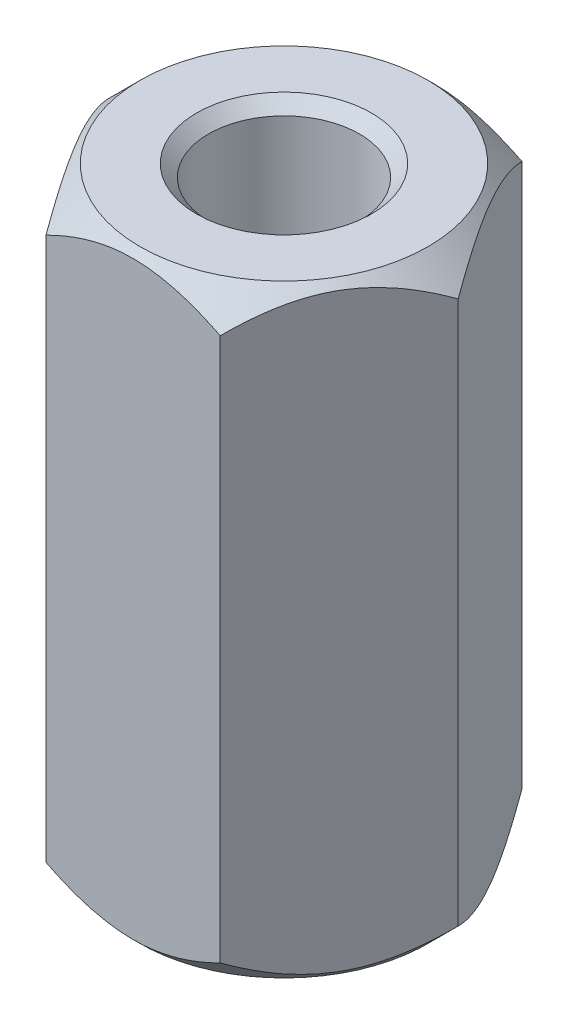
ISO-10303-21;
HEADER;
FILE_DESCRIPTION(('STEP AP214'),'2;1');
FILE_NAME('part.step','',(''),(''),'','','');
FILE_SCHEMA(('AUTOMOTIVE_DESIGN { 1 0 10303 214 1 1 1 1 }'));
ENDSEC;
DATA;
#1=APPLICATION_CONTEXT('core data for automotive mechanical design processes');
#2=APPLICATION_PROTOCOL_DEFINITION('international standard','automotive_design',2000,#1);
#3=PRODUCT_CONTEXT('',#1,'mechanical');
#4=PRODUCT('Part','Part','',(#3));
#5=PRODUCT_RELATED_PRODUCT_CATEGORY('part','',(#4));
#6=PRODUCT_DEFINITION_FORMATION('','',#4);
#7=PRODUCT_DEFINITION_CONTEXT('part definition',#1,'design');
#8=PRODUCT_DEFINITION('design','',#6,#7);
#9=PRODUCT_DEFINITION_SHAPE('','',#8);
#10=(LENGTH_UNIT() NAMED_UNIT(*) SI_UNIT(.MILLI.,.METRE.));
#11=(NAMED_UNIT(*) PLANE_ANGLE_UNIT() SI_UNIT($,.RADIAN.));
#12=(NAMED_UNIT(*) SI_UNIT($,.STERADIAN.) SOLID_ANGLE_UNIT());
#13=UNCERTAINTY_MEASURE_WITH_UNIT(LENGTH_MEASURE(1.E-05),#10,'distance_accuracy_value','');
#14=(GEOMETRIC_REPRESENTATION_CONTEXT(3) GLOBAL_UNCERTAINTY_ASSIGNED_CONTEXT((#13)) GLOBAL_UNIT_ASSIGNED_CONTEXT((#10,
#11,#12)) REPRESENTATION_CONTEXT('',''));
#15=CARTESIAN_POINT('',(0.,0.,0.));
#16=DIRECTION('',(0.,0.,1.));
#17=DIRECTION('',(1.,0.,0.));
#18=AXIS2_PLACEMENT_3D('',#15,#16,#17);
#19=CARTESIAN_POINT('',(0.,10.,0.));
#20=DIRECTION('',(0.,1.,0.));
#21=DIRECTION('',(0.,0.,1.));
#22=AXIS2_PLACEMENT_3D('',#19,#20,#21);
#23=PLANE('',#22);
#24=CARTESIAN_POINT('',(0.,10.,0.));
#25=DIRECTION('',(0.,1.,0.));
#26=DIRECTION('',(0.,0.,1.));
#27=AXIS2_PLACEMENT_3D('',#24,#25,#26);
#28=CIRCLE('',#27,1.45);
#29=CARTESIAN_POINT('',(0.,10.,1.45));
#30=VERTEX_POINT('',#29);
#31=EDGE_CURVE('E156',#30,#30,#28,.F.);
#32=ORIENTED_EDGE('',*,*,#31,.T.);
#33=EDGE_LOOP('',(#32));
#34=FACE_BOUND('',#33,.T.);
#35=CARTESIAN_POINT('',(0.,10.,0.));
#36=DIRECTION('',(0.,-1.,0.));
#37=DIRECTION('',(0.,0.,-1.));
#38=AXIS2_PLACEMENT_3D('',#35,#36,#37);
#39=CIRCLE('',#38,2.38675134594813);
#40=CARTESIAN_POINT('',(0.,10.,-2.38675134594813));
#41=VERTEX_POINT('',#40);
#42=EDGE_CURVE('E264',#41,#41,#39,.T.);
#43=ORIENTED_EDGE('',*,*,#42,.F.);
#44=EDGE_LOOP('',(#43));
#45=FACE_BOUND('',#44,.T.);
#46=ADVANCED_FACE('F41',(#34,#45),#23,.T.);
#47=CARTESIAN_POINT('',(0.,0.,0.));
#48=DIRECTION('',(0.,1.,0.));
#49=DIRECTION('',(0.,0.,1.));
#50=AXIS2_PLACEMENT_3D('',#47,#48,#49);
#51=PLANE('',#50);
#52=CARTESIAN_POINT('',(0.,0.,0.));
#53=DIRECTION('',(0.,-1.,0.));
#54=DIRECTION('',(0.,0.,-1.));
#55=AXIS2_PLACEMENT_3D('',#52,#53,#54);
#56=CIRCLE('',#55,2.38675134594813);
#57=CARTESIAN_POINT('',(0.,0.,-2.38675134594813));
#58=VERTEX_POINT('',#57);
#59=EDGE_CURVE('E269',#58,#58,#56,.T.);
#60=ORIENTED_EDGE('',*,*,#59,.T.);
#61=EDGE_LOOP('',(#60));
#62=FACE_BOUND('',#61,.T.);
#63=CARTESIAN_POINT('',(0.,0.,0.));
#64=DIRECTION('',(0.,1.,0.));
#65=DIRECTION('',(0.,0.,1.));
#66=AXIS2_PLACEMENT_3D('',#63,#64,#65);
#67=CIRCLE('',#66,1.45);
#68=CARTESIAN_POINT('',(0.,0.,1.45));
#69=VERTEX_POINT('',#68);
#70=EDGE_CURVE('E135',#69,#69,#67,.T.);
#71=ORIENTED_EDGE('',*,*,#70,.T.);
#72=EDGE_LOOP('',(#71));
#73=FACE_BOUND('',#72,.T.);
#74=ADVANCED_FACE('F277',(#62,#73),#51,.F.);
#75=CARTESIAN_POINT('',(0.,10.,0.));
#76=DIRECTION('',(0.,-1.,0.));
#77=DIRECTION('',(0.,0.,-1.));
#78=AXIS2_PLACEMENT_3D('',#75,#76,#77);
#79=CYLINDRICAL_SURFACE('',#78,1.25);
#80=CARTESIAN_POINT('',(0.,0.200000000000001,0.));
#81=DIRECTION('',(0.,1.,0.));
#82=DIRECTION('',(0.,0.,1.));
#83=AXIS2_PLACEMENT_3D('',#80,#81,#82);
#84=CIRCLE('',#83,1.25);
#85=CARTESIAN_POINT('',(0.,0.200000000000001,1.25));
#86=VERTEX_POINT('',#85);
#87=EDGE_CURVE('E152',#86,#86,#84,.F.);
#88=ORIENTED_EDGE('',*,*,#87,.T.);
#89=EDGE_LOOP('',(#88));
#90=FACE_BOUND('',#89,.T.);
#91=CARTESIAN_POINT('',(0.,9.8,0.));
#92=DIRECTION('',(0.,1.,0.));
#93=DIRECTION('',(0.,0.,1.));
#94=AXIS2_PLACEMENT_3D('',#91,#92,#93);
#95=CIRCLE('',#94,1.25);
#96=CARTESIAN_POINT('',(0.,9.8,1.25));
#97=VERTEX_POINT('',#96);
#98=EDGE_CURVE('E142',#97,#97,#95,.T.);
#99=ORIENTED_EDGE('',*,*,#98,.T.);
#100=EDGE_LOOP('',(#99));
#101=FACE_BOUND('',#100,.T.);
#102=ADVANCED_FACE('F175',(#90,#101),#79,.F.);
#103=CARTESIAN_POINT('',(0.,0.,0.));
#104=DIRECTION('',(0.,-1.,0.));
#105=DIRECTION('',(0.,0.,-1.));
#106=AXIS2_PLACEMENT_3D('',#103,#104,#105);
#107=CONICAL_SURFACE('',#106,1.45,0.785398163397451);
#108=ORIENTED_EDGE('',*,*,#87,.F.);
#109=EDGE_LOOP('',(#108));
#110=FACE_BOUND('',#109,.T.);
#111=ORIENTED_EDGE('',*,*,#70,.F.);
#112=EDGE_LOOP('',(#111));
#113=FACE_BOUND('',#112,.T.);
#114=ADVANCED_FACE('F282',(#110,#113),#107,.F.);
#115=CARTESIAN_POINT('',(0.,9.8,0.));
#116=DIRECTION('',(0.,1.,0.));
#117=DIRECTION('',(0.,0.,1.));
#118=AXIS2_PLACEMENT_3D('',#115,#116,#117);
#119=CONICAL_SURFACE('',#118,1.25,0.785398163397447);
#120=ORIENTED_EDGE('',*,*,#31,.F.);
#121=EDGE_LOOP('',(#120));
#122=FACE_BOUND('',#121,.T.);
#123=ORIENTED_EDGE('',*,*,#98,.F.);
#124=EDGE_LOOP('',(#123));
#125=FACE_BOUND('',#124,.T.);
#126=ADVANCED_FACE('F44',(#122,#125),#119,.F.);
#127=CARTESIAN_POINT('',(0.,0.5,0.));
#128=DIRECTION('',(0.,1.,0.));
#129=DIRECTION('',(0.,0.,1.));
#130=AXIS2_PLACEMENT_3D('',#127,#128,#129);
#131=CONICAL_SURFACE('',#130,2.88675134594813,0.785398163397448);
#132=ORIENTED_EDGE('',*,*,#59,.F.);
#133=EDGE_LOOP('',(#132));
#134=FACE_BOUND('',#133,.T.);
#135=CARTESIAN_POINT('',(1.44326020292023,0.500115476981765,2.5002));
#136=CARTESIAN_POINT('',(1.49287669073468,0.450540705354728,2.41426172221224));
#137=CARTESIAN_POINT('',(1.5433228376411,0.403877481362506,2.32688643272425));
#138=CARTESIAN_POINT('',(1.64618811625259,0.318438140038302,2.14871854383441));
#139=CARTESIAN_POINT('',(1.69861703122359,0.279709562406002,2.05790899931893));
#140=CARTESIAN_POINT('',(1.80433744175985,0.213366703897739,1.87479587687308));
#141=CARTESIAN_POINT('',(1.85760201171315,0.185585668530856,1.78253893547066));
#142=CARTESIAN_POINT('',(1.96530378549009,0.142783175910666,1.59599399122372));
#143=CARTESIAN_POINT('',(2.01973769896306,0.127729766671344,1.50171168743372));
#144=CARTESIAN_POINT('',(2.11355131286832,0.114147722209481,1.33922174170816));
#145=CARTESIAN_POINT('',(2.15280980880341,0.112137099240801,1.27122403211985));
#146=CARTESIAN_POINT('',(2.23126263056549,0.115524117187488,1.13533975883078));
#147=CARTESIAN_POINT('',(2.27045692907357,0.12092435529982,1.06745324244777));
#148=CARTESIAN_POINT('',(2.34847544336504,0.138825788402472,0.932321211763899));
#149=CARTESIAN_POINT('',(2.38729919566122,0.15133492704648,0.865076500246444));
#150=CARTESIAN_POINT('',(2.46427534467603,0.182767501955706,0.731749899181806));
#151=CARTESIAN_POINT('',(2.50242779262541,0.201690446496817,0.665667920900348));
#152=CARTESIAN_POINT('',(2.60015256308361,0.257867361408246,0.49640365330874));
#153=CARTESIAN_POINT('',(2.65911894852988,0.299355831596186,0.394270877777111));
#154=CARTESIAN_POINT('',(2.74582384890657,0.369394046723088,0.244093585059494));
#155=CARTESIAN_POINT('',(2.77439698586412,0.394002252116074,0.194603460117393));
#156=CARTESIAN_POINT('',(2.83101398781794,0.445461886715235,0.0965399361611541));
#157=CARTESIAN_POINT('',(2.85905816495513,0.472311938779356,0.0479659965030725));
#158=CARTESIAN_POINT('',(2.88686681600197,0.500115476981765,-0.000199999999999819));
#159=B_SPLINE_CURVE_WITH_KNOTS('',3,(#135,#136,#137,#138,#139,#140,#141,#142,#143,#144,#145,
#146,#147,#148,#149,#150,#151,#152,#153,#154,#155,#156,#157,#158),.UNSPECIFIED.,.F.,.F.,(4,2,2,
2,2,2,2,2,2,2,2,4),(0.,0.333012085133923,0.667964518301396,0.997597032043297,1.32639954393844,
1.56169424147168,1.79707142102082,2.0327121352217,2.2683347877565,2.64260240809533,
2.82922877818864,3.01574133749025),.UNSPECIFIED.);
#160=CARTESIAN_POINT('',(1.44337567297406,0.5,2.5));
#161=VERTEX_POINT('',#160);
#162=CARTESIAN_POINT('',(2.88675134594813,0.5,0.));
#163=VERTEX_POINT('',#162);
#164=EDGE_CURVE('E57',#161,#163,#159,.T.);
#165=ORIENTED_EDGE('',*,*,#164,.F.);
#166=CARTESIAN_POINT('',(-4.37330831151522,2.65069101973389,2.5));
#167=CARTESIAN_POINT('',(-4.24403891339305,2.53850828595441,2.5));
#168=CARTESIAN_POINT('',(-4.11419779057852,2.42697083242165,2.5));
#169=CARTESIAN_POINT('',(-3.85292831776437,2.20564673414319,2.5));
#170=CARTESIAN_POINT('',(-3.72149924661623,2.09586094177348,2.5));
#171=CARTESIAN_POINT('',(-3.45372373243149,1.87613936282999,2.5));
#172=CARTESIAN_POINT('',(-3.31733341076398,1.76625684230869,2.5));
#173=CARTESIAN_POINT('',(-3.04199251465964,1.54980326125021,2.5));
#174=CARTESIAN_POINT('',(-2.90304258923331,1.44323137919174,2.5));
#175=CARTESIAN_POINT('',(-2.62155122685079,1.23451661377687,2.5));
#176=CARTESIAN_POINT('',(-2.47900532618292,1.13237971133423,2.5));
#177=CARTESIAN_POINT('',(-2.18923565754107,0.934620051384672,2.5));
#178=CARTESIAN_POINT('',(-2.0420082049592,0.839002620916072,2.5));
#179=CARTESIAN_POINT('',(-1.74264031099183,0.658345048643878,2.5));
#180=CARTESIAN_POINT('',(-1.59054539844743,0.573230443151914,2.5));
#181=CARTESIAN_POINT('',(-1.27884700562957,0.41810967075028,2.5));
#182=CARTESIAN_POINT('',(-1.11925792354922,0.348075868732266,2.5));
#183=CARTESIAN_POINT('',(-0.871746541156393,0.259727643601026,2.5));
#184=CARTESIAN_POINT('',(-0.786892324781199,0.232859478936288,2.5));
#185=CARTESIAN_POINT('',(-0.615167909356123,0.186495703040525,2.5));
#186=CARTESIAN_POINT('',(-0.528298034126085,0.166998916167443,2.5));
#187=CARTESIAN_POINT('',(-0.353593154862556,0.136675918402707,2.5));
#188=CARTESIAN_POINT('',(-0.265767670553387,0.125795891290058,2.5));
#189=CARTESIAN_POINT('',(-0.0894544026248823,0.113303806761095,2.5));
#190=CARTESIAN_POINT('',(-0.000966693475837861,0.111690722460558,2.5));
#191=CARTESIAN_POINT('',(0.175810523180242,0.117862685412344,2.5));
#192=CARTESIAN_POINT('',(0.264099508971327,0.125662341658241,2.5));
#193=CARTESIAN_POINT('',(0.439438821736604,0.150088988425528,2.5));
#194=CARTESIAN_POINT('',(0.526488897979867,0.166717740414045,2.5));
#195=CARTESIAN_POINT('',(0.699335269567239,0.207851477940081,2.5));
#196=CARTESIAN_POINT('',(0.785118069808452,0.232412173795672,2.5));
#197=CARTESIAN_POINT('',(0.954502739735362,0.288070453345723,2.5));
#198=CARTESIAN_POINT('',(1.03810457634724,0.319168136107411,2.5));
#199=CARTESIAN_POINT('',(1.22117743579866,0.394047706308,2.5));
#200=CARTESIAN_POINT('',(1.32011771074674,0.439116117071025,2.5));
#201=CARTESIAN_POINT('',(1.51505599272674,0.535268622396139,2.5));
#202=CARTESIAN_POINT('',(1.61105226698903,0.586356177180437,2.5));
#203=CARTESIAN_POINT('',(1.80064305278511,0.693211834080635,2.5));
#204=CARTESIAN_POINT('',(1.89423220185576,0.748989373251979,2.5));
#205=CARTESIAN_POINT('',(2.07918348925537,0.86405882340105,2.5));
#206=CARTESIAN_POINT('',(2.17054606308418,0.923350039219493,2.5));
#207=CARTESIAN_POINT('',(2.35190572333799,1.04499939060216,2.5));
#208=CARTESIAN_POINT('',(2.44189291292773,1.10737221266217,2.5));
#209=CARTESIAN_POINT('',(2.62030949566039,1.23431260012175,2.5));
#210=CARTESIAN_POINT('',(2.70873877055447,1.29888033103894,2.5));
#211=CARTESIAN_POINT('',(2.97186750498212,1.49503424460034,2.5));
#212=CARTESIAN_POINT('',(3.14462607468669,1.62922074653838,2.5));
#213=CARTESIAN_POINT('',(3.49618284627761,1.90993648836438,2.5));
#214=CARTESIAN_POINT('',(3.67476512358034,2.05673353168176,2.5));
#215=CARTESIAN_POINT('',(3.93944124625689,2.27875476952709,2.5));
#216=CARTESIAN_POINT('',(4.02665635053339,2.35264928946925,2.5));
#217=CARTESIAN_POINT('',(4.20043882061448,2.5011578688468,2.5));
#218=CARTESIAN_POINT('',(4.28700632493623,2.57577176611582,2.5));
#219=CARTESIAN_POINT('',(4.37330831151522,2.65069101973389,2.5));
#220=B_SPLINE_CURVE_WITH_KNOTS('',3,(#166,#167,#168,#169,#170,#171,#172,#173,#174,#175,#176,
#177,#178,#179,#180,#181,#182,#183,#184,#185,#186,#187,#188,#189,#190,#191,#192,#193,#194,#195,
#196,#197,#198,#199,#200,#201,#202,#203,#204,#205,#206,#207,#208,#209,#210,#211,#212,#213,#214,
#215,#216,#217,#218,#219),.UNSPECIFIED.,.F.,.F.,(4,2,2,2,2,2,2,2,2,2,2,2,2,2,2,2,2,2,2,2,2,2,2,
2,2,2,4),(0.,0.513489343339091,1.02722137052991,1.5526256728989,2.0778985396552,
2.60385907177581,3.13024433807344,3.65265219152264,4.17409444495664,4.44084802746818,
4.70755904817345,4.9725908841579,5.23759335098937,5.50300764297449,5.76847490689832,
6.03584878933086,6.3032267240737,6.62911493104157,6.95519140377336,7.28194046381501,
7.60862509299869,7.9370542005098,8.26550812997353,8.92162297206542,9.61508301907986,
9.95801106567934,10.3008635353394),.UNSPECIFIED.);
#221=CARTESIAN_POINT('',(-1.44337567297406,0.5,2.5));
#222=VERTEX_POINT('',#221);
#223=EDGE_CURVE('E182',#222,#161,#220,.T.);
#224=ORIENTED_EDGE('',*,*,#223,.F.);
#225=CARTESIAN_POINT('',(-2.88686681600197,0.500115476981765,-0.000199999999999099));
#226=CARTESIAN_POINT('',(-2.83725032818751,0.450540705354727,0.0857382777877655));
#227=CARTESIAN_POINT('',(-2.7868041812811,0.403877481362506,0.173113567275754));
#228=CARTESIAN_POINT('',(-2.6839389026696,0.318438140038302,0.351281456165588));
#229=CARTESIAN_POINT('',(-2.6315099876986,0.279709562406003,0.442091000681074));
#230=CARTESIAN_POINT('',(-2.52578957716234,0.213366703897739,0.625204123126919));
#231=CARTESIAN_POINT('',(-2.47252500720904,0.185585668530856,0.717461064529339));
#232=CARTESIAN_POINT('',(-2.3648232334321,0.142783175910666,0.904006008776283));
#233=CARTESIAN_POINT('',(-2.31038931995913,0.127729766671344,0.998288312566281));
#234=CARTESIAN_POINT('',(-2.21657570605387,0.114147722209482,1.16077825829184));
#235=CARTESIAN_POINT('',(-2.17731721011878,0.112137099240801,1.22877596788015));
#236=CARTESIAN_POINT('',(-2.0988643883567,0.115524117187488,1.36466024116922));
#237=CARTESIAN_POINT('',(-2.05967008984862,0.12092435529982,1.43254675755223));
#238=CARTESIAN_POINT('',(-1.98165157555715,0.138825788402471,1.5676787882361));
#239=CARTESIAN_POINT('',(-1.94282782326097,0.151334927046479,1.63492349975355));
#240=CARTESIAN_POINT('',(-1.86585167424616,0.182767501955705,1.76825010081819));
#241=CARTESIAN_POINT('',(-1.82769922629678,0.201690446496817,1.83433207909965));
#242=CARTESIAN_POINT('',(-1.72997445583858,0.257867361408246,2.00359634669126));
#243=CARTESIAN_POINT('',(-1.67100807039231,0.299355831596185,2.10572912222289));
#244=CARTESIAN_POINT('',(-1.58430317001562,0.369394046723087,2.25590641494051));
#245=CARTESIAN_POINT('',(-1.55573003305807,0.394002252116073,2.30539653988261));
#246=CARTESIAN_POINT('',(-1.49911303110425,0.445461886715236,2.40346006383885));
#247=CARTESIAN_POINT('',(-1.47106885396706,0.472311938779356,2.45203400349693));
#248=CARTESIAN_POINT('',(-1.44326020292022,0.500115476981764,2.5002));
#249=B_SPLINE_CURVE_WITH_KNOTS('',3,(#225,#226,#227,#228,#229,#230,#231,#232,#233,#234,#235,
#236,#237,#238,#239,#240,#241,#242,#243,#244,#245,#246,#247,#248),.UNSPECIFIED.,.F.,.F.,(4,2,2,
2,2,2,2,2,2,2,2,4),(0.,0.333012085133923,0.667964518301395,0.997597032043296,1.32639954393844,
1.56169424147168,1.79707142102082,2.0327121352217,2.2683347877565,2.64260240809533,
2.82922877818864,3.01574133749025),.UNSPECIFIED.);
#250=CARTESIAN_POINT('',(-2.88675134594813,0.5,0.));
#251=VERTEX_POINT('',#250);
#252=EDGE_CURVE('E190',#251,#222,#249,.T.);
#253=ORIENTED_EDGE('',*,*,#252,.F.);
#254=CARTESIAN_POINT('',(-1.44326020292023,0.500115476981765,-2.5002));
#255=CARTESIAN_POINT('',(-1.49287669073468,0.450540705354727,-2.41426172221223));
#256=CARTESIAN_POINT('',(-1.5433228376411,0.403877481362506,-2.32688643272425));
#257=CARTESIAN_POINT('',(-1.64618811625259,0.318438140038301,-2.14871854383441));
#258=CARTESIAN_POINT('',(-1.69861703122359,0.279709562406002,-2.05790899931892));
#259=CARTESIAN_POINT('',(-1.80433744175985,0.213366703897739,-1.87479587687308));
#260=CARTESIAN_POINT('',(-1.85760201171315,0.185585668530856,-1.78253893547066));
#261=CARTESIAN_POINT('',(-1.96530378549009,0.142783175910666,-1.59599399122372));
#262=CARTESIAN_POINT('',(-2.01973769896306,0.127729766671344,-1.50171168743372));
#263=CARTESIAN_POINT('',(-2.11355131286832,0.114147722209482,-1.33922174170816));
#264=CARTESIAN_POINT('',(-2.15280980880341,0.112137099240802,-1.27122403211985));
#265=CARTESIAN_POINT('',(-2.23126263056549,0.115524117187488,-1.13533975883078));
#266=CARTESIAN_POINT('',(-2.27045692907357,0.12092435529982,-1.06745324244776));
#267=CARTESIAN_POINT('',(-2.34847544336504,0.138825788402471,-0.932321211763898));
#268=CARTESIAN_POINT('',(-2.38729919566122,0.15133492704648,-0.865076500246443));
#269=CARTESIAN_POINT('',(-2.46427534467603,0.182767501955706,-0.731749899181805));
#270=CARTESIAN_POINT('',(-2.50242779262541,0.201690446496817,-0.665667920900347));
#271=CARTESIAN_POINT('',(-2.60015256308361,0.257867361408246,-0.496403653308739));
#272=CARTESIAN_POINT('',(-2.65911894852988,0.299355831596186,-0.39427087777711));
#273=CARTESIAN_POINT('',(-2.74582384890657,0.369394046723087,-0.244093585059492));
#274=CARTESIAN_POINT('',(-2.77439698586412,0.394002252116074,-0.194603460117391));
#275=CARTESIAN_POINT('',(-2.83101398781794,0.445461886715236,-0.0965399361611533));
#276=CARTESIAN_POINT('',(-2.85905816495513,0.472311938779357,-0.0479659965030718));
#277=CARTESIAN_POINT('',(-2.88686681600197,0.500115476981765,0.000200000000001053));
#278=B_SPLINE_CURVE_WITH_KNOTS('',3,(#254,#255,#256,#257,#258,#259,#260,#261,#262,#263,#264,
#265,#266,#267,#268,#269,#270,#271,#272,#273,#274,#275,#276,#277),.UNSPECIFIED.,.F.,.F.,(4,2,2,
2,2,2,2,2,2,2,2,4),(0.,0.333012085133924,0.667964518301396,0.997597032043297,1.32639954393844,
1.56169424147168,1.79707142102082,2.0327121352217,2.2683347877565,2.64260240809533,
2.82922877818864,3.01574133749025),.UNSPECIFIED.);
#279=CARTESIAN_POINT('',(-1.44337567297406,0.5,-2.5));
#280=VERTEX_POINT('',#279);
#281=EDGE_CURVE('E114',#280,#251,#278,.T.);
#282=ORIENTED_EDGE('',*,*,#281,.F.);
#283=CARTESIAN_POINT('',(4.37330831151522,2.6506910197339,-2.5));
#284=CARTESIAN_POINT('',(4.24403891339305,2.53850828595442,-2.5));
#285=CARTESIAN_POINT('',(4.11419779057853,2.42697083242165,-2.5));
#286=CARTESIAN_POINT('',(3.85292831776437,2.2056467341432,-2.5));
#287=CARTESIAN_POINT('',(3.72149924661623,2.09586094177348,-2.5));
#288=CARTESIAN_POINT('',(3.45372373243149,1.87613936283,-2.5));
#289=CARTESIAN_POINT('',(3.31733341076398,1.76625684230869,-2.5));
#290=CARTESIAN_POINT('',(3.04199251465964,1.54980326125022,-2.5));
#291=CARTESIAN_POINT('',(2.90304258923331,1.44323137919174,-2.5));
#292=CARTESIAN_POINT('',(2.62155122685079,1.23451661377687,-2.5));
#293=CARTESIAN_POINT('',(2.47900532618293,1.13237971133423,-2.5));
#294=CARTESIAN_POINT('',(2.18923565754107,0.934620051384673,-2.5));
#295=CARTESIAN_POINT('',(2.04200820495921,0.839002620916073,-2.5));
#296=CARTESIAN_POINT('',(1.74264031099183,0.658345048643879,-2.5));
#297=CARTESIAN_POINT('',(1.59054539844744,0.573230443151915,-2.5));
#298=CARTESIAN_POINT('',(1.27884700562958,0.418109670750281,-2.5));
#299=CARTESIAN_POINT('',(1.11925792354922,0.348075868732266,-2.5));
#300=CARTESIAN_POINT('',(0.871746541156397,0.259727643601026,-2.5));
#301=CARTESIAN_POINT('',(0.786892324781203,0.232859478936288,-2.5));
#302=CARTESIAN_POINT('',(0.615167909356126,0.186495703040526,-2.5));
#303=CARTESIAN_POINT('',(0.528298034126089,0.166998916167443,-2.5));
#304=CARTESIAN_POINT('',(0.353593154862559,0.136675918402707,-2.5));
#305=CARTESIAN_POINT('',(0.265767670553391,0.125795891290058,-2.5));
#306=CARTESIAN_POINT('',(0.0894544026248862,0.113303806761094,-2.5));
#307=CARTESIAN_POINT('',(0.000966693475841317,0.111690722460557,-2.5));
#308=CARTESIAN_POINT('',(-0.175810523180239,0.117862685412343,-2.5));
#309=CARTESIAN_POINT('',(-0.264099508971324,0.12566234165824,-2.5));
#310=CARTESIAN_POINT('',(-0.439438821736602,0.150088988425527,-2.5));
#311=CARTESIAN_POINT('',(-0.526488897979865,0.166717740414043,-2.5));
#312=CARTESIAN_POINT('',(-0.699335269567236,0.207851477940079,-2.5));
#313=CARTESIAN_POINT('',(-0.785118069808449,0.23241217379567,-2.5));
#314=CARTESIAN_POINT('',(-0.954502739735359,0.288070453345721,-2.5));
#315=CARTESIAN_POINT('',(-1.03810457634723,0.319168136107409,-2.5));
#316=CARTESIAN_POINT('',(-1.22117743579866,0.394047706307999,-2.5));
#317=CARTESIAN_POINT('',(-1.32011771074674,0.439116117071023,-2.5));
#318=CARTESIAN_POINT('',(-1.51505599272673,0.535268622396137,-2.5));
#319=CARTESIAN_POINT('',(-1.61105226698903,0.586356177180435,-2.5));
#320=CARTESIAN_POINT('',(-1.8006430527851,0.693211834080632,-2.5));
#321=CARTESIAN_POINT('',(-1.89423220185575,0.748989373251976,-2.5));
#322=CARTESIAN_POINT('',(-2.07918348925536,0.864058823401047,-2.5));
#323=CARTESIAN_POINT('',(-2.17054606308418,0.92335003921949,-2.5));
#324=CARTESIAN_POINT('',(-2.35190572333799,1.04499939060215,-2.5));
#325=CARTESIAN_POINT('',(-2.44189291292772,1.10737221266217,-2.5));
#326=CARTESIAN_POINT('',(-2.62030949566038,1.23431260012175,-2.5));
#327=CARTESIAN_POINT('',(-2.70873877055446,1.29888033103894,-2.5));
#328=CARTESIAN_POINT('',(-2.97186750498212,1.49503424460033,-2.5));
#329=CARTESIAN_POINT('',(-3.14462607468668,1.62922074653837,-2.5));
#330=CARTESIAN_POINT('',(-3.49618284627761,1.90993648836437,-2.5));
#331=CARTESIAN_POINT('',(-3.67476512358033,2.05673353168176,-2.5));
#332=CARTESIAN_POINT('',(-3.93944124625689,2.27875476952709,-2.5));
#333=CARTESIAN_POINT('',(-4.02665635053339,2.35264928946925,-2.5));
#334=CARTESIAN_POINT('',(-4.20043882061448,2.5011578688468,-2.5));
#335=CARTESIAN_POINT('',(-4.28700632493623,2.57577176611582,-2.5));
#336=CARTESIAN_POINT('',(-4.37330831151522,2.6506910197339,-2.5));
#337=B_SPLINE_CURVE_WITH_KNOTS('',3,(#283,#284,#285,#286,#287,#288,#289,#290,#291,#292,#293,
#294,#295,#296,#297,#298,#299,#300,#301,#302,#303,#304,#305,#306,#307,#308,#309,#310,#311,#312,
#313,#314,#315,#316,#317,#318,#319,#320,#321,#322,#323,#324,#325,#326,#327,#328,#329,#330,#331,
#332,#333,#334,#335,#336),.UNSPECIFIED.,.F.,.F.,(4,2,2,2,2,2,2,2,2,2,2,2,2,2,2,2,2,2,2,2,2,2,2,
2,2,2,4),(0.,0.51348934333909,1.02722137052991,1.5526256728989,2.0778985396552,2.60385907177581,
3.13024433807344,3.65265219152264,4.17409444495665,4.44084802746818,4.70755904817345,
4.9725908841579,5.23759335098937,5.5030076429745,5.76847490689832,6.03584878933086,
6.3032267240737,6.62911493104157,6.95519140377336,7.28194046381501,7.60862509299869,
7.9370542005098,8.26550812997353,8.92162297206541,9.61508301907986,9.95801106567934,
10.3008635353394),.UNSPECIFIED.);
#338=CARTESIAN_POINT('',(1.44337567297406,0.5,-2.5));
#339=VERTEX_POINT('',#338);
#340=EDGE_CURVE('E111',#339,#280,#337,.T.);
#341=ORIENTED_EDGE('',*,*,#340,.F.);
#342=CARTESIAN_POINT('',(2.88686681600197,0.500115476981765,0.00020000000000005));
#343=CARTESIAN_POINT('',(2.83725032818751,0.450540705354728,-0.0857382777877645));
#344=CARTESIAN_POINT('',(2.7868041812811,0.403877481362506,-0.173113567275753));
#345=CARTESIAN_POINT('',(2.6839389026696,0.318438140038302,-0.351281456165587));
#346=CARTESIAN_POINT('',(2.6315099876986,0.279709562406003,-0.442091000681073));
#347=CARTESIAN_POINT('',(2.52578957716234,0.213366703897739,-0.625204123126919));
#348=CARTESIAN_POINT('',(2.47252500720904,0.185585668530857,-0.717461064529338));
#349=CARTESIAN_POINT('',(2.3648232334321,0.142783175910666,-0.904006008776283));
#350=CARTESIAN_POINT('',(2.31038931995913,0.127729766671344,-0.99828831256628));
#351=CARTESIAN_POINT('',(2.21657570605387,0.114147722209482,-1.16077825829184));
#352=CARTESIAN_POINT('',(2.17731721011878,0.112137099240802,-1.22877596788015));
#353=CARTESIAN_POINT('',(2.0988643883567,0.115524117187488,-1.36466024116922));
#354=CARTESIAN_POINT('',(2.05967008984862,0.12092435529982,-1.43254675755223));
#355=CARTESIAN_POINT('',(1.98165157555715,0.138825788402471,-1.5676787882361));
#356=CARTESIAN_POINT('',(1.94282782326097,0.15133492704648,-1.63492349975355));
#357=CARTESIAN_POINT('',(1.86585167424616,0.182767501955706,-1.76825010081819));
#358=CARTESIAN_POINT('',(1.82769922629678,0.201690446496817,-1.83433207909965));
#359=CARTESIAN_POINT('',(1.72997445583858,0.257867361408246,-2.00359634669126));
#360=CARTESIAN_POINT('',(1.67100807039231,0.299355831596186,-2.10572912222289));
#361=CARTESIAN_POINT('',(1.58430317001562,0.369394046723087,-2.25590641494051));
#362=CARTESIAN_POINT('',(1.55573003305807,0.394002252116073,-2.30539653988261));
#363=CARTESIAN_POINT('',(1.49911303110426,0.445461886715235,-2.40346006383884));
#364=CARTESIAN_POINT('',(1.47106885396706,0.472311938779356,-2.45203400349693));
#365=CARTESIAN_POINT('',(1.44326020292023,0.500115476981764,-2.5002));
#366=B_SPLINE_CURVE_WITH_KNOTS('',3,(#342,#343,#344,#345,#346,#347,#348,#349,#350,#351,#352,
#353,#354,#355,#356,#357,#358,#359,#360,#361,#362,#363,#364,#365),.UNSPECIFIED.,.F.,.F.,(4,2,2,
2,2,2,2,2,2,2,2,4),(0.,0.333012085133923,0.667964518301395,0.997597032043297,1.32639954393844,
1.56169424147168,1.79707142102082,2.0327121352217,2.2683347877565,2.64260240809533,
2.82922877818863,3.01574133749025),.UNSPECIFIED.);
#367=EDGE_CURVE('E77',#163,#339,#366,.T.);
#368=ORIENTED_EDGE('',*,*,#367,.F.);
#369=EDGE_LOOP('',(#165,#224,#253,#282,#341,#368));
#370=FACE_BOUND('',#369,.T.);
#371=ADVANCED_FACE('F112',(#134,#370),#131,.T.);
#372=CARTESIAN_POINT('',(0.,10.,0.));
#373=DIRECTION('',(0.,-1.,0.));
#374=DIRECTION('',(0.,0.,-1.));
#375=AXIS2_PLACEMENT_3D('',#372,#373,#374);
#376=CONICAL_SURFACE('',#375,2.38675134594813,0.785398163397448);
#377=ORIENTED_EDGE('',*,*,#42,.T.);
#378=EDGE_LOOP('',(#377));
#379=FACE_BOUND('',#378,.T.);
#380=CARTESIAN_POINT('',(-4.37330831151522,7.3493089802661,-2.5));
#381=CARTESIAN_POINT('',(-4.24403891339305,7.46149171404558,-2.5));
#382=CARTESIAN_POINT('',(-4.11419779057853,7.57302916757835,-2.5));
#383=CARTESIAN_POINT('',(-3.85292831776437,7.79435326585681,-2.5));
#384=CARTESIAN_POINT('',(-3.72149924661623,7.90413905822652,-2.5));
#385=CARTESIAN_POINT('',(-3.45372373243149,8.12386063717,-2.5));
#386=CARTESIAN_POINT('',(-3.31733341076398,8.23374315769131,-2.5));
#387=CARTESIAN_POINT('',(-3.04199251465964,8.45019673874978,-2.5));
#388=CARTESIAN_POINT('',(-2.90304258923331,8.55676862080826,-2.5));
#389=CARTESIAN_POINT('',(-2.62155122685079,8.76548338622313,-2.5));
#390=CARTESIAN_POINT('',(-2.47900532618293,8.86762028866577,-2.5));
#391=CARTESIAN_POINT('',(-2.18923565754107,9.06537994861533,-2.5));
#392=CARTESIAN_POINT('',(-2.0420082049592,9.16099737908393,-2.5));
#393=CARTESIAN_POINT('',(-1.74264031099183,9.34165495135612,-2.5));
#394=CARTESIAN_POINT('',(-1.59054539844744,9.42676955684808,-2.5));
#395=CARTESIAN_POINT('',(-1.27884700562958,9.58189032924972,-2.5));
#396=CARTESIAN_POINT('',(-1.11925792354922,9.65192413126774,-2.5));
#397=CARTESIAN_POINT('',(-0.871746541156396,9.74027235639898,-2.5));
#398=CARTESIAN_POINT('',(-0.786892324781202,9.76714052106371,-2.5));
#399=CARTESIAN_POINT('',(-0.615167909356125,9.81350429695948,-2.5));
#400=CARTESIAN_POINT('',(-0.528298034126088,9.83300108383256,-2.5));
#401=CARTESIAN_POINT('',(-0.353593154862558,9.86332408159729,-2.5));
#402=CARTESIAN_POINT('',(-0.26576767055339,9.87420410870994,-2.5));
#403=CARTESIAN_POINT('',(-0.0894544026248848,9.88669619323891,-2.5));
#404=CARTESIAN_POINT('',(-0.000966693475840151,9.88830927753944,-2.5));
#405=CARTESIAN_POINT('',(0.17581052318024,9.88213731458766,-2.5));
#406=CARTESIAN_POINT('',(0.264099508971325,9.87433765834176,-2.5));
#407=CARTESIAN_POINT('',(0.439438821736603,9.84991101157447,-2.5));
#408=CARTESIAN_POINT('',(0.526488897979866,9.83328225958596,-2.5));
#409=CARTESIAN_POINT('',(0.699335269567237,9.79214852205992,-2.5));
#410=CARTESIAN_POINT('',(0.78511806980845,9.76758782620433,-2.5));
#411=CARTESIAN_POINT('',(0.954502739735359,9.71192954665428,-2.5));
#412=CARTESIAN_POINT('',(1.03810457634723,9.68083186389259,-2.5));
#413=CARTESIAN_POINT('',(1.22117743579866,9.605952293692,-2.5));
#414=CARTESIAN_POINT('',(1.32011771074674,9.56088388292898,-2.5));
#415=CARTESIAN_POINT('',(1.51505599272673,9.46473137760386,-2.5));
#416=CARTESIAN_POINT('',(1.61105226698903,9.41364382281957,-2.5));
#417=CARTESIAN_POINT('',(1.8006430527851,9.30678816591937,-2.5));
#418=CARTESIAN_POINT('',(1.89423220185575,9.25101062674802,-2.5));
#419=CARTESIAN_POINT('',(2.07918348925536,9.13594117659895,-2.5));
#420=CARTESIAN_POINT('',(2.17054606308417,9.07664996078051,-2.5));
#421=CARTESIAN_POINT('',(2.35190572333799,8.95500060939785,-2.5));
#422=CARTESIAN_POINT('',(2.44189291292772,8.89262778733783,-2.5));
#423=CARTESIAN_POINT('',(2.62030949566038,8.76568739987825,-2.5));
#424=CARTESIAN_POINT('',(2.70873877055446,8.70111966896106,-2.5));
#425=CARTESIAN_POINT('',(2.97186750498212,8.50496575539967,-2.5));
#426=CARTESIAN_POINT('',(3.14462607468668,8.37077925346163,-2.5));
#427=CARTESIAN_POINT('',(3.49618284627761,8.09006351163563,-2.5));
#428=CARTESIAN_POINT('',(3.67476512358034,7.94326646831824,-2.5));
#429=CARTESIAN_POINT('',(3.93944124625689,7.72124523047291,-2.5));
#430=CARTESIAN_POINT('',(4.02665635053339,7.64735071053075,-2.5));
#431=CARTESIAN_POINT('',(4.20043882061448,7.49884213115321,-2.5));
#432=CARTESIAN_POINT('',(4.28700632493623,7.42422823388418,-2.5));
#433=CARTESIAN_POINT('',(4.37330831151522,7.34930898026611,-2.5));
#434=B_SPLINE_CURVE_WITH_KNOTS('',3,(#380,#381,#382,#383,#384,#385,#386,#387,#388,#389,#390,
#391,#392,#393,#394,#395,#396,#397,#398,#399,#400,#401,#402,#403,#404,#405,#406,#407,#408,#409,
#410,#411,#412,#413,#414,#415,#416,#417,#418,#419,#420,#421,#422,#423,#424,#425,#426,#427,#428,
#429,#430,#431,#432,#433),.UNSPECIFIED.,.F.,.F.,(4,2,2,2,2,2,2,2,2,2,2,2,2,2,2,2,2,2,2,2,2,2,2,
2,2,2,4),(0.,0.51348934333909,1.02722137052991,1.5526256728989,2.0778985396552,2.60385907177581,
3.13024433807345,3.65265219152264,4.17409444495665,4.44084802746819,4.70755904817345,
4.9725908841579,5.23759335098937,5.5030076429745,5.76847490689832,6.03584878933086,
6.3032267240737,6.62911493104157,6.95519140377336,7.28194046381501,7.60862509299868,
7.9370542005098,8.26550812997352,8.92162297206541,9.61508301907985,9.95801106567934,
10.3008635353394),.UNSPECIFIED.);
#435=CARTESIAN_POINT('',(-1.44337567297406,9.5,-2.5));
#436=VERTEX_POINT('',#435);
#437=CARTESIAN_POINT('',(1.44337567297406,9.5,-2.5));
#438=VERTEX_POINT('',#437);
#439=EDGE_CURVE('E133',#436,#438,#434,.T.);
#440=ORIENTED_EDGE('',*,*,#439,.F.);
#441=CARTESIAN_POINT('',(-2.88686681600197,9.49988452301824,0.00020000000000095));
#442=CARTESIAN_POINT('',(-2.83725032818751,9.54945929464527,-0.0857382777877642));
#443=CARTESIAN_POINT('',(-2.7868041812811,9.59612251863749,-0.173113567275752));
#444=CARTESIAN_POINT('',(-2.6839389026696,9.6815618599617,-0.351281456165587));
#445=CARTESIAN_POINT('',(-2.6315099876986,9.720290437594,-0.442091000681072));
#446=CARTESIAN_POINT('',(-2.52578957716234,9.78663329610226,-0.625204123126918));
#447=CARTESIAN_POINT('',(-2.47252500720904,9.81441433146914,-0.717461064529337));
#448=CARTESIAN_POINT('',(-2.3648232334321,9.85721682408933,-0.904006008776282));
#449=CARTESIAN_POINT('',(-2.31038931995913,9.87227023332866,-0.998288312566279));
#450=CARTESIAN_POINT('',(-2.21657570605387,9.88585227779052,-1.16077825829184));
#451=CARTESIAN_POINT('',(-2.17731721011878,9.8878629007592,-1.22877596788015));
#452=CARTESIAN_POINT('',(-2.0988643883567,9.88447588281251,-1.36466024116921));
#453=CARTESIAN_POINT('',(-2.05967008984862,9.87907564470018,-1.43254675755223));
#454=CARTESIAN_POINT('',(-1.98165157555715,9.86117421159753,-1.5676787882361));
#455=CARTESIAN_POINT('',(-1.94282782326097,9.84866507295352,-1.63492349975355));
#456=CARTESIAN_POINT('',(-1.86585167424616,9.81723249804429,-1.76825010081819));
#457=CARTESIAN_POINT('',(-1.82769922629678,9.79830955350318,-1.83433207909965));
#458=CARTESIAN_POINT('',(-1.72997445583858,9.74213263859176,-2.00359634669126));
#459=CARTESIAN_POINT('',(-1.67100807039231,9.70064416840381,-2.10572912222289));
#460=CARTESIAN_POINT('',(-1.58430317001562,9.63060595327691,-2.2559064149405));
#461=CARTESIAN_POINT('',(-1.55573003305807,9.60599774788393,-2.30539653988261));
#462=CARTESIAN_POINT('',(-1.49911303110426,9.55453811328477,-2.40346006383884));
#463=CARTESIAN_POINT('',(-1.47106885396706,9.52768806122065,-2.45203400349693));
#464=CARTESIAN_POINT('',(-1.44326020292023,9.49988452301824,-2.5002));
#465=B_SPLINE_CURVE_WITH_KNOTS('',3,(#441,#442,#443,#444,#445,#446,#447,#448,#449,#450,#451,
#452,#453,#454,#455,#456,#457,#458,#459,#460,#461,#462,#463,#464),.UNSPECIFIED.,.F.,.F.,(4,2,2,
2,2,2,2,2,2,2,2,4),(0.,0.333012085133923,0.667964518301395,0.997597032043296,1.32639954393844,
1.56169424147168,1.79707142102082,2.0327121352217,2.2683347877565,2.64260240809533,
2.82922877818863,3.01574133749025),.UNSPECIFIED.);
#466=CARTESIAN_POINT('',(-2.88675134594813,9.5,0.));
#467=VERTEX_POINT('',#466);
#468=EDGE_CURVE('E227',#467,#436,#465,.T.);
#469=ORIENTED_EDGE('',*,*,#468,.F.);
#470=CARTESIAN_POINT('',(-1.44326020292022,9.49988452301824,2.5002));
#471=CARTESIAN_POINT('',(-1.49287669073468,9.54945929464527,2.41426172221224));
#472=CARTESIAN_POINT('',(-1.54332283764109,9.59612251863749,2.32688643272425));
#473=CARTESIAN_POINT('',(-1.64618811625259,9.6815618599617,2.14871854383441));
#474=CARTESIAN_POINT('',(-1.69861703122359,9.720290437594,2.05790899931893));
#475=CARTESIAN_POINT('',(-1.80433744175985,9.78663329610226,1.87479587687308));
#476=CARTESIAN_POINT('',(-1.85760201171315,9.81441433146914,1.78253893547066));
#477=CARTESIAN_POINT('',(-1.96530378549009,9.85721682408933,1.59599399122372));
#478=CARTESIAN_POINT('',(-2.01973769896306,9.87227023332866,1.50171168743372));
#479=CARTESIAN_POINT('',(-2.11355131286832,9.88585227779052,1.33922174170816));
#480=CARTESIAN_POINT('',(-2.15280980880341,9.8878629007592,1.27122403211985));
#481=CARTESIAN_POINT('',(-2.23126263056549,9.88447588281251,1.13533975883079));
#482=CARTESIAN_POINT('',(-2.27045692907357,9.87907564470018,1.06745324244777));
#483=CARTESIAN_POINT('',(-2.34847544336504,9.86117421159753,0.932321211763902));
#484=CARTESIAN_POINT('',(-2.38729919566122,9.84866507295352,0.865076500246448));
#485=CARTESIAN_POINT('',(-2.46427534467603,9.81723249804429,0.73174989918181));
#486=CARTESIAN_POINT('',(-2.50242779262541,9.79830955350318,0.665667920900352));
#487=CARTESIAN_POINT('',(-2.60015256308361,9.74213263859176,0.496403653308743));
#488=CARTESIAN_POINT('',(-2.65911894852988,9.70064416840381,0.394270877777114));
#489=CARTESIAN_POINT('',(-2.74582384890657,9.63060595327691,0.244093585059496));
#490=CARTESIAN_POINT('',(-2.77439698586412,9.60599774788393,0.194603460117395));
#491=CARTESIAN_POINT('',(-2.83101398781794,9.55453811328477,0.096539936161156));
#492=CARTESIAN_POINT('',(-2.85905816495513,9.52768806122065,0.047965996503074));
#493=CARTESIAN_POINT('',(-2.88686681600197,9.49988452301824,-0.000199999999998583));
#494=B_SPLINE_CURVE_WITH_KNOTS('',3,(#470,#471,#472,#473,#474,#475,#476,#477,#478,#479,#480,
#481,#482,#483,#484,#485,#486,#487,#488,#489,#490,#491,#492,#493),.UNSPECIFIED.,.F.,.F.,(4,2,2,
2,2,2,2,2,2,2,2,4),(0.,0.333012085133923,0.667964518301395,0.997597032043295,1.32639954393844,
1.56169424147168,1.79707142102082,2.0327121352217,2.26833478775649,2.64260240809532,
2.82922877818863,3.01574133749025),.UNSPECIFIED.);
#495=CARTESIAN_POINT('',(-1.44337567297406,9.5,2.5));
#496=VERTEX_POINT('',#495);
#497=EDGE_CURVE('E257',#496,#467,#494,.T.);
#498=ORIENTED_EDGE('',*,*,#497,.F.);
#499=CARTESIAN_POINT('',(4.37330831151522,7.34930898026611,2.5));
#500=CARTESIAN_POINT('',(4.24403891339305,7.46149171404558,2.5));
#501=CARTESIAN_POINT('',(4.11419779057852,7.57302916757835,2.5));
#502=CARTESIAN_POINT('',(3.85292831776437,7.79435326585681,2.5));
#503=CARTESIAN_POINT('',(3.72149924661623,7.90413905822652,2.5));
#504=CARTESIAN_POINT('',(3.45372373243149,8.12386063717001,2.5));
#505=CARTESIAN_POINT('',(3.31733341076398,8.23374315769131,2.5));
#506=CARTESIAN_POINT('',(3.04199251465964,8.45019673874978,2.5));
#507=CARTESIAN_POINT('',(2.90304258923331,8.55676862080826,2.5));
#508=CARTESIAN_POINT('',(2.62155122685079,8.76548338622313,2.5));
#509=CARTESIAN_POINT('',(2.47900532618292,8.86762028866577,2.5));
#510=CARTESIAN_POINT('',(2.18923565754107,9.06537994861533,2.5));
#511=CARTESIAN_POINT('',(2.0420082049592,9.16099737908393,2.5));
#512=CARTESIAN_POINT('',(1.74264031099183,9.34165495135612,2.5));
#513=CARTESIAN_POINT('',(1.59054539844744,9.42676955684808,2.5));
#514=CARTESIAN_POINT('',(1.27884700562957,9.58189032924972,2.5));
#515=CARTESIAN_POINT('',(1.11925792354922,9.65192413126773,2.5));
#516=CARTESIAN_POINT('',(0.871746541156394,9.74027235639897,2.5));
#517=CARTESIAN_POINT('',(0.786892324781201,9.76714052106371,2.5));
#518=CARTESIAN_POINT('',(0.615167909356125,9.81350429695948,2.5));
#519=CARTESIAN_POINT('',(0.528298034126087,9.83300108383256,2.5));
#520=CARTESIAN_POINT('',(0.353593154862558,9.86332408159729,2.5));
#521=CARTESIAN_POINT('',(0.265767670553389,9.87420410870994,2.5));
#522=CARTESIAN_POINT('',(0.0894544026248846,9.88669619323891,2.5));
#523=CARTESIAN_POINT('',(0.000966693475840029,9.88830927753944,2.5));
#524=CARTESIAN_POINT('',(-0.175810523180241,9.88213731458766,2.5));
#525=CARTESIAN_POINT('',(-0.264099508971326,9.87433765834176,2.5));
#526=CARTESIAN_POINT('',(-0.439438821736603,9.84991101157447,2.5));
#527=CARTESIAN_POINT('',(-0.526488897979866,9.83328225958595,2.5));
#528=CARTESIAN_POINT('',(-0.699335269567237,9.79214852205992,2.5));
#529=CARTESIAN_POINT('',(-0.78511806980845,9.76758782620433,2.5));
#530=CARTESIAN_POINT('',(-0.954502739735359,9.71192954665428,2.5));
#531=CARTESIAN_POINT('',(-1.03810457634723,9.68083186389259,2.5));
#532=CARTESIAN_POINT('',(-1.22117743579866,9.605952293692,2.5));
#533=CARTESIAN_POINT('',(-1.32011771074674,9.56088388292898,2.5));
#534=CARTESIAN_POINT('',(-1.51505599272673,9.46473137760386,2.5));
#535=CARTESIAN_POINT('',(-1.61105226698903,9.41364382281957,2.5));
#536=CARTESIAN_POINT('',(-1.8006430527851,9.30678816591937,2.5));
#537=CARTESIAN_POINT('',(-1.89423220185575,9.25101062674802,2.5));
#538=CARTESIAN_POINT('',(-2.07918348925536,9.13594117659895,2.5));
#539=CARTESIAN_POINT('',(-2.17054606308417,9.07664996078051,2.5));
#540=CARTESIAN_POINT('',(-2.35190572333799,8.95500060939785,2.5));
#541=CARTESIAN_POINT('',(-2.44189291292772,8.89262778733783,2.5));
#542=CARTESIAN_POINT('',(-2.62030949566038,8.76568739987825,2.5));
#543=CARTESIAN_POINT('',(-2.70873877055446,8.70111966896106,2.5));
#544=CARTESIAN_POINT('',(-2.97186750498212,8.50496575539967,2.5));
#545=CARTESIAN_POINT('',(-3.14462607468668,8.37077925346163,2.5));
#546=CARTESIAN_POINT('',(-3.4961828462776,8.09006351163563,2.5));
#547=CARTESIAN_POINT('',(-3.67476512358033,7.94326646831824,2.5));
#548=CARTESIAN_POINT('',(-3.93944124625688,7.72124523047291,2.5));
#549=CARTESIAN_POINT('',(-4.02665635053339,7.64735071053076,2.5));
#550=CARTESIAN_POINT('',(-4.20043882061448,7.49884213115321,2.5));
#551=CARTESIAN_POINT('',(-4.28700632493623,7.42422823388418,2.5));
#552=CARTESIAN_POINT('',(-4.37330831151522,7.34930898026611,2.5));
#553=B_SPLINE_CURVE_WITH_KNOTS('',3,(#499,#500,#501,#502,#503,#504,#505,#506,#507,#508,#509,
#510,#511,#512,#513,#514,#515,#516,#517,#518,#519,#520,#521,#522,#523,#524,#525,#526,#527,#528,
#529,#530,#531,#532,#533,#534,#535,#536,#537,#538,#539,#540,#541,#542,#543,#544,#545,#546,#547,
#548,#549,#550,#551,#552),.UNSPECIFIED.,.F.,.F.,(4,2,2,2,2,2,2,2,2,2,2,2,2,2,2,2,2,2,2,2,2,2,2,
2,2,2,4),(0.,0.513489343339091,1.02722137052991,1.5526256728989,2.0778985396552,
2.60385907177581,3.13024433807344,3.65265219152264,4.17409444495664,4.44084802746818,
4.70755904817345,4.9725908841579,5.23759335098937,5.50300764297449,5.76847490689831,
6.03584878933086,6.3032267240737,6.62911493104157,6.95519140377335,7.28194046381501,
7.60862509299868,7.9370542005098,8.26550812997352,8.92162297206541,9.61508301907985,
9.95801106567933,10.3008635353394),.UNSPECIFIED.);
#554=CARTESIAN_POINT('',(1.44337567297406,9.5,2.5));
#555=VERTEX_POINT('',#554);
#556=EDGE_CURVE('E67',#555,#496,#553,.T.);
#557=ORIENTED_EDGE('',*,*,#556,.F.);
#558=CARTESIAN_POINT('',(2.88686681600197,9.49988452301824,-0.0002));
#559=CARTESIAN_POINT('',(2.83725032818751,9.54945929464527,0.0857382777877648));
#560=CARTESIAN_POINT('',(2.7868041812811,9.59612251863749,0.173113567275753));
#561=CARTESIAN_POINT('',(2.6839389026696,9.6815618599617,0.351281456165588));
#562=CARTESIAN_POINT('',(2.6315099876986,9.720290437594,0.442091000681073));
#563=CARTESIAN_POINT('',(2.52578957716234,9.78663329610226,0.625204123126918));
#564=CARTESIAN_POINT('',(2.47252500720904,9.81441433146914,0.717461064529338));
#565=CARTESIAN_POINT('',(2.3648232334321,9.85721682408933,0.904006008776283));
#566=CARTESIAN_POINT('',(2.31038931995913,9.87227023332866,0.99828831256628));
#567=CARTESIAN_POINT('',(2.21657570605387,9.88585227779052,1.16077825829184));
#568=CARTESIAN_POINT('',(2.17731721011878,9.8878629007592,1.22877596788015));
#569=CARTESIAN_POINT('',(2.0988643883567,9.88447588281251,1.36466024116921));
#570=CARTESIAN_POINT('',(2.05967008984862,9.87907564470018,1.43254675755223));
#571=CARTESIAN_POINT('',(1.98165157555715,9.86117421159753,1.5676787882361));
#572=CARTESIAN_POINT('',(1.94282782326097,9.84866507295352,1.63492349975355));
#573=CARTESIAN_POINT('',(1.86585167424616,9.81723249804429,1.76825010081819));
#574=CARTESIAN_POINT('',(1.82769922629678,9.79830955350318,1.83433207909965));
#575=CARTESIAN_POINT('',(1.72997445583858,9.74213263859176,2.00359634669126));
#576=CARTESIAN_POINT('',(1.67100807039231,9.70064416840381,2.10572912222289));
#577=CARTESIAN_POINT('',(1.58430317001562,9.63060595327691,2.2559064149405));
#578=CARTESIAN_POINT('',(1.55573003305807,9.60599774788393,2.30539653988261));
#579=CARTESIAN_POINT('',(1.49911303110426,9.55453811328477,2.40346006383884));
#580=CARTESIAN_POINT('',(1.47106885396706,9.52768806122064,2.45203400349693));
#581=CARTESIAN_POINT('',(1.44326020292023,9.49988452301824,2.5002));
#582=B_SPLINE_CURVE_WITH_KNOTS('',3,(#558,#559,#560,#561,#562,#563,#564,#565,#566,#567,#568,
#569,#570,#571,#572,#573,#574,#575,#576,#577,#578,#579,#580,#581),.UNSPECIFIED.,.F.,.F.,(4,2,2,
2,2,2,2,2,2,2,2,4),(0.,0.333012085133923,0.667964518301394,0.997597032043295,1.32639954393844,
1.56169424147168,1.79707142102082,2.0327121352217,2.2683347877565,2.64260240809533,
2.82922877818863,3.01574133749025),.UNSPECIFIED.);
#583=CARTESIAN_POINT('',(2.88675134594813,9.5,0.));
#584=VERTEX_POINT('',#583);
#585=EDGE_CURVE('E11',#584,#555,#582,.T.);
#586=ORIENTED_EDGE('',*,*,#585,.F.);
#587=CARTESIAN_POINT('',(1.44326020292023,9.49988452301824,-2.5002));
#588=CARTESIAN_POINT('',(1.49287669073469,9.54945929464527,-2.41426172221223));
#589=CARTESIAN_POINT('',(1.5433228376411,9.59612251863749,-2.32688643272425));
#590=CARTESIAN_POINT('',(1.64618811625259,9.6815618599617,-2.14871854383441));
#591=CARTESIAN_POINT('',(1.69861703122359,9.720290437594,-2.05790899931892));
#592=CARTESIAN_POINT('',(1.80433744175985,9.78663329610226,-1.87479587687308));
#593=CARTESIAN_POINT('',(1.85760201171315,9.81441433146914,-1.78253893547066));
#594=CARTESIAN_POINT('',(1.96530378549009,9.85721682408933,-1.59599399122371));
#595=CARTESIAN_POINT('',(2.01973769896306,9.87227023332866,-1.50171168743372));
#596=CARTESIAN_POINT('',(2.11355131286832,9.88585227779052,-1.33922174170816));
#597=CARTESIAN_POINT('',(2.15280980880341,9.8878629007592,-1.27122403211985));
#598=CARTESIAN_POINT('',(2.23126263056549,9.88447588281251,-1.13533975883078));
#599=CARTESIAN_POINT('',(2.27045692907357,9.87907564470018,-1.06745324244776));
#600=CARTESIAN_POINT('',(2.34847544336504,9.86117421159753,-0.932321211763896));
#601=CARTESIAN_POINT('',(2.38729919566123,9.84866507295352,-0.865076500246442));
#602=CARTESIAN_POINT('',(2.46427534467603,9.81723249804429,-0.731749899181804));
#603=CARTESIAN_POINT('',(2.50242779262541,9.79830955350318,-0.665667920900346));
#604=CARTESIAN_POINT('',(2.60015256308361,9.74213263859175,-0.496403653308738));
#605=CARTESIAN_POINT('',(2.65911894852988,9.70064416840381,-0.394270877777109));
#606=CARTESIAN_POINT('',(2.74582384890657,9.63060595327691,-0.244093585059493));
#607=CARTESIAN_POINT('',(2.77439698586412,9.60599774788393,-0.194603460117393));
#608=CARTESIAN_POINT('',(2.83101398781794,9.55453811328476,-0.0965399361611548));
#609=CARTESIAN_POINT('',(2.85905816495513,9.52768806122064,-0.0479659965030734));
#610=CARTESIAN_POINT('',(2.88686681600197,9.49988452301824,0.000199999999999381));
#611=B_SPLINE_CURVE_WITH_KNOTS('',3,(#587,#588,#589,#590,#591,#592,#593,#594,#595,#596,#597,
#598,#599,#600,#601,#602,#603,#604,#605,#606,#607,#608,#609,#610),.UNSPECIFIED.,.F.,.F.,(4,2,2,
2,2,2,2,2,2,2,2,4),(0.,0.333012085133923,0.667964518301396,0.997597032043297,1.32639954393844,
1.56169424147168,1.79707142102082,2.0327121352217,2.2683347877565,2.64260240809533,
2.82922877818863,3.01574133749024),.UNSPECIFIED.);
#612=EDGE_CURVE('E226',#438,#584,#611,.T.);
#613=ORIENTED_EDGE('',*,*,#612,.F.);
#614=EDGE_LOOP('',(#440,#469,#498,#557,#586,#613));
#615=FACE_BOUND('',#614,.T.);
#616=ADVANCED_FACE('F172',(#379,#615),#376,.T.);
#617=CARTESIAN_POINT('',(1.44337567297406,10.,2.5));
#618=DIRECTION('',(-0.866025403784439,0.,-0.5));
#619=DIRECTION('',(-0.5,0.,0.866025403784439));
#620=AXIS2_PLACEMENT_3D('',#617,#618,#619);
#621=PLANE('',#620);
#622=DIRECTION('',(0.,-1.,0.));
#623=VECTOR('',#622,1.);
#624=CARTESIAN_POINT('',(2.88675134594813,10.,0.));
#625=LINE('',#624,#623);
#626=EDGE_CURVE('E128',#584,#163,#625,.T.);
#627=ORIENTED_EDGE('',*,*,#626,.F.);
#628=ORIENTED_EDGE('',*,*,#585,.T.);
#629=DIRECTION('',(0.,-1.,0.));
#630=VECTOR('',#629,1.);
#631=CARTESIAN_POINT('',(1.44337567297406,10.,2.5));
#632=LINE('',#631,#630);
#633=EDGE_CURVE('E240',#555,#161,#632,.T.);
#634=ORIENTED_EDGE('',*,*,#633,.T.);
#635=ORIENTED_EDGE('',*,*,#164,.T.);
#636=EDGE_LOOP('',(#627,#628,#634,#635));
#637=FACE_BOUND('',#636,.T.);
#638=ADVANCED_FACE('F165',(#637),#621,.F.);
#639=CARTESIAN_POINT('',(-1.44337567297406,10.,2.5));
#640=DIRECTION('',(0.,0.,-1.));
#641=DIRECTION('',(-1.,0.,0.));
#642=AXIS2_PLACEMENT_3D('',#639,#640,#641);
#643=PLANE('',#642);
#644=ORIENTED_EDGE('',*,*,#633,.F.);
#645=ORIENTED_EDGE('',*,*,#556,.T.);
#646=DIRECTION('',(0.,-1.,0.));
#647=VECTOR('',#646,1.);
#648=CARTESIAN_POINT('',(-1.44337567297406,10.,2.5));
#649=LINE('',#648,#647);
#650=EDGE_CURVE('E244',#496,#222,#649,.T.);
#651=ORIENTED_EDGE('',*,*,#650,.T.);
#652=ORIENTED_EDGE('',*,*,#223,.T.);
#653=EDGE_LOOP('',(#644,#645,#651,#652));
#654=FACE_BOUND('',#653,.T.);
#655=ADVANCED_FACE('F320',(#654),#643,.F.);
#656=CARTESIAN_POINT('',(-2.88675134594813,10.,0.));
#657=DIRECTION('',(0.866025403784438,0.,-0.5));
#658=DIRECTION('',(-0.5,0.,-0.866025403784438));
#659=AXIS2_PLACEMENT_3D('',#656,#657,#658);
#660=PLANE('',#659);
#661=ORIENTED_EDGE('',*,*,#650,.F.);
#662=ORIENTED_EDGE('',*,*,#497,.T.);
#663=DIRECTION('',(0.,-1.,0.));
#664=VECTOR('',#663,1.);
#665=CARTESIAN_POINT('',(-2.88675134594813,10.,0.));
#666=LINE('',#665,#664);
#667=EDGE_CURVE('E145',#467,#251,#666,.T.);
#668=ORIENTED_EDGE('',*,*,#667,.T.);
#669=ORIENTED_EDGE('',*,*,#252,.T.);
#670=EDGE_LOOP('',(#661,#662,#668,#669));
#671=FACE_BOUND('',#670,.T.);
#672=ADVANCED_FACE('F256',(#671),#660,.F.);
#673=CARTESIAN_POINT('',(-1.44337567297406,10.,-2.5));
#674=DIRECTION('',(0.866025403784439,0.,0.5));
#675=DIRECTION('',(0.5,0.,-0.866025403784439));
#676=AXIS2_PLACEMENT_3D('',#673,#674,#675);
#677=PLANE('',#676);
#678=ORIENTED_EDGE('',*,*,#667,.F.);
#679=ORIENTED_EDGE('',*,*,#468,.T.);
#680=DIRECTION('',(0.,-1.,0.));
#681=VECTOR('',#680,1.);
#682=CARTESIAN_POINT('',(-1.44337567297406,10.,-2.5));
#683=LINE('',#682,#681);
#684=EDGE_CURVE('E136',#436,#280,#683,.T.);
#685=ORIENTED_EDGE('',*,*,#684,.T.);
#686=ORIENTED_EDGE('',*,*,#281,.T.);
#687=EDGE_LOOP('',(#678,#679,#685,#686));
#688=FACE_BOUND('',#687,.T.);
#689=ADVANCED_FACE('F215',(#688),#677,.F.);
#690=CARTESIAN_POINT('',(1.44337567297406,10.,-2.5));
#691=DIRECTION('',(0.,0.,1.));
#692=DIRECTION('',(1.,0.,0.));
#693=AXIS2_PLACEMENT_3D('',#690,#691,#692);
#694=PLANE('',#693);
#695=ORIENTED_EDGE('',*,*,#684,.F.);
#696=ORIENTED_EDGE('',*,*,#439,.T.);
#697=DIRECTION('',(0.,-1.,0.));
#698=VECTOR('',#697,1.);
#699=CARTESIAN_POINT('',(1.44337567297406,10.,-2.5));
#700=LINE('',#699,#698);
#701=EDGE_CURVE('E126',#438,#339,#700,.T.);
#702=ORIENTED_EDGE('',*,*,#701,.T.);
#703=ORIENTED_EDGE('',*,*,#340,.T.);
#704=EDGE_LOOP('',(#695,#696,#702,#703));
#705=FACE_BOUND('',#704,.T.);
#706=ADVANCED_FACE('F132',(#705),#694,.F.);
#707=CARTESIAN_POINT('',(2.88675134594813,10.,0.));
#708=DIRECTION('',(-0.866025403784439,0.,0.5));
#709=DIRECTION('',(0.5,0.,0.866025403784439));
#710=AXIS2_PLACEMENT_3D('',#707,#708,#709);
#711=PLANE('',#710);
#712=ORIENTED_EDGE('',*,*,#701,.F.);
#713=ORIENTED_EDGE('',*,*,#612,.T.);
#714=ORIENTED_EDGE('',*,*,#626,.T.);
#715=ORIENTED_EDGE('',*,*,#367,.T.);
#716=EDGE_LOOP('',(#712,#713,#714,#715));
#717=FACE_BOUND('',#716,.T.);
#718=ADVANCED_FACE('F124',(#717),#711,.F.);
#719=CLOSED_SHELL('',(#46,#74,#102,#114,#126,#371,#616,#638,#655,#672,#689,#706,#718));
#720=MANIFOLD_SOLID_BREP('B2',#719);
#721=ADVANCED_BREP_SHAPE_REPRESENTATION('',(#18,#720),#14);
#722=SHAPE_DEFINITION_REPRESENTATION(#9,#721);
ENDSEC;
END-ISO-10303-21;
